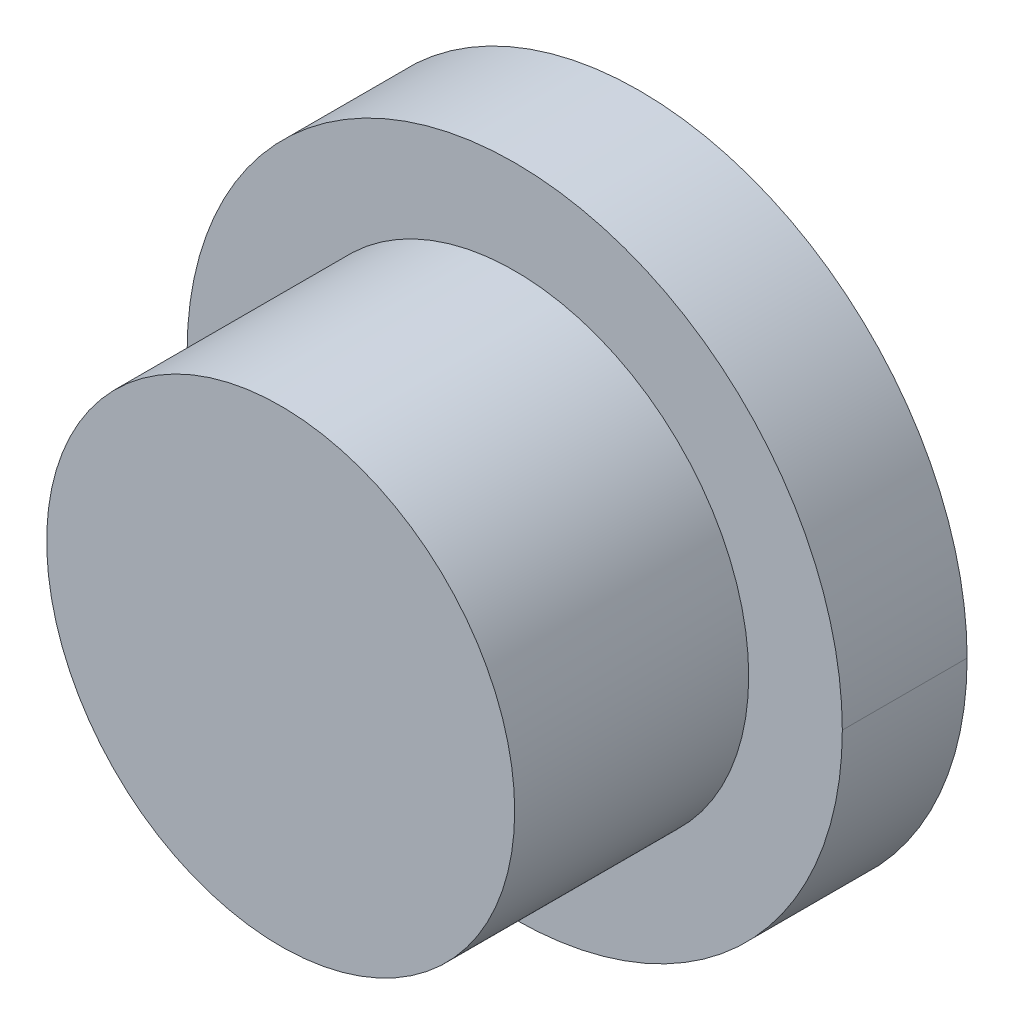
ISO-10303-21;
HEADER;
FILE_DESCRIPTION(('STEP AP214'),'2;1');
FILE_NAME('part.step','',(''),(''),'','','');
FILE_SCHEMA(('AUTOMOTIVE_DESIGN { 1 0 10303 214 1 1 1 1 }'));
ENDSEC;
DATA;
#1=APPLICATION_CONTEXT('core data for automotive mechanical design processes');
#2=APPLICATION_PROTOCOL_DEFINITION('international standard','automotive_design',2000,#1);
#3=PRODUCT_CONTEXT('',#1,'mechanical');
#4=PRODUCT('Part','Part','',(#3));
#5=PRODUCT_RELATED_PRODUCT_CATEGORY('part','',(#4));
#6=PRODUCT_DEFINITION_FORMATION('','',#4);
#7=PRODUCT_DEFINITION_CONTEXT('part definition',#1,'design');
#8=PRODUCT_DEFINITION('design','',#6,#7);
#9=PRODUCT_DEFINITION_SHAPE('','',#8);
#10=(LENGTH_UNIT() NAMED_UNIT(*) SI_UNIT(.MILLI.,.METRE.));
#11=(NAMED_UNIT(*) PLANE_ANGLE_UNIT() SI_UNIT($,.RADIAN.));
#12=(NAMED_UNIT(*) SI_UNIT($,.STERADIAN.) SOLID_ANGLE_UNIT());
#13=UNCERTAINTY_MEASURE_WITH_UNIT(LENGTH_MEASURE(1.E-05),#10,'distance_accuracy_value','');
#14=(GEOMETRIC_REPRESENTATION_CONTEXT(3) GLOBAL_UNCERTAINTY_ASSIGNED_CONTEXT((#13)) GLOBAL_UNIT_ASSIGNED_CONTEXT((#10,
#11,#12)) REPRESENTATION_CONTEXT('',''));
#15=CARTESIAN_POINT('',(0.,0.,0.));
#16=DIRECTION('',(0.,0.,1.));
#17=DIRECTION('',(1.,0.,0.));
#18=AXIS2_PLACEMENT_3D('',#15,#16,#17);
#19=CARTESIAN_POINT('',(0.,0.,-4.));
#20=DIRECTION('',(0.,0.,1.));
#21=DIRECTION('',(1.,0.,0.));
#22=AXIS2_PLACEMENT_3D('',#19,#20,#21);
#23=CYLINDRICAL_SURFACE('',#22,10.5);
#24=CARTESIAN_POINT('',(0.,0.,-4.));
#25=DIRECTION('',(0.,0.,-1.));
#26=DIRECTION('',(-1.,0.,0.));
#27=AXIS2_PLACEMENT_3D('',#24,#25,#26);
#28=CIRCLE('',#27,10.5);
#29=CARTESIAN_POINT('',(-10.5,0.,-4.));
#30=VERTEX_POINT('',#29);
#31=CARTESIAN_POINT('',(10.5,0.,-4.));
#32=VERTEX_POINT('',#31);
#33=EDGE_CURVE('E71',#30,#32,#28,.T.);
#34=ORIENTED_EDGE('',*,*,#33,.F.);
#35=DIRECTION('',(0.,0.,1.));
#36=VECTOR('',#35,1.);
#37=CARTESIAN_POINT('',(-10.5,0.,-4.));
#38=LINE('',#37,#36);
#39=CARTESIAN_POINT('',(-10.5,0.,0.));
#40=VERTEX_POINT('',#39);
#41=EDGE_CURVE('E11',#30,#40,#38,.T.);
#42=ORIENTED_EDGE('',*,*,#41,.T.);
#43=CARTESIAN_POINT('',(0.,0.,0.));
#44=DIRECTION('',(0.,0.,-1.));
#45=DIRECTION('',(-1.,0.,0.));
#46=AXIS2_PLACEMENT_3D('',#43,#44,#45);
#47=CIRCLE('',#46,10.5);
#48=CARTESIAN_POINT('',(10.5,0.,0.));
#49=VERTEX_POINT('',#48);
#50=EDGE_CURVE('E59',#40,#49,#47,.T.);
#51=ORIENTED_EDGE('',*,*,#50,.T.);
#52=DIRECTION('',(0.,0.,1.));
#53=VECTOR('',#52,1.);
#54=CARTESIAN_POINT('',(10.5,0.,-4.));
#55=LINE('',#54,#53);
#56=EDGE_CURVE('E111',#32,#49,#55,.T.);
#57=ORIENTED_EDGE('',*,*,#56,.F.);
#58=EDGE_LOOP('',(#34,#42,#51,#57));
#59=FACE_BOUND('',#58,.T.);
#60=ADVANCED_FACE('F48',(#59),#23,.T.);
#61=CARTESIAN_POINT('',(0.,0.,5.));
#62=DIRECTION('',(0.,0.,-1.));
#63=DIRECTION('',(-1.,0.,0.));
#64=AXIS2_PLACEMENT_3D('',#61,#62,#63);
#65=CYLINDRICAL_SURFACE('',#64,7.5);
#66=DIRECTION('',(0.,0.,-1.));
#67=VECTOR('',#66,1.);
#68=CARTESIAN_POINT('',(-7.5,0.,5.));
#69=LINE('',#68,#67);
#70=CARTESIAN_POINT('',(-7.5,0.,5.));
#71=VERTEX_POINT('',#70);
#72=CARTESIAN_POINT('',(-7.5,0.,0.));
#73=VERTEX_POINT('',#72);
#74=EDGE_CURVE('E105',#71,#73,#69,.T.);
#75=ORIENTED_EDGE('',*,*,#74,.F.);
#76=ORIENTED_EDGE('',*,*,#74,.T.);
#77=CARTESIAN_POINT('',(0.,0.,0.));
#78=DIRECTION('',(0.,0.,1.));
#79=DIRECTION('',(1.,0.,0.));
#80=AXIS2_PLACEMENT_3D('',#77,#78,#79);
#81=CIRCLE('',#80,7.5);
#82=CARTESIAN_POINT('',(7.5,0.,0.));
#83=VERTEX_POINT('',#82);
#84=EDGE_CURVE('E102',#73,#83,#81,.T.);
#85=ORIENTED_EDGE('',*,*,#84,.T.);
#86=DIRECTION('',(0.,0.,-1.));
#87=VECTOR('',#86,1.);
#88=CARTESIAN_POINT('',(7.5,0.,5.));
#89=LINE('',#88,#87);
#90=CARTESIAN_POINT('',(7.5,0.,5.));
#91=VERTEX_POINT('',#90);
#92=EDGE_CURVE('E94',#91,#83,#89,.T.);
#93=ORIENTED_EDGE('',*,*,#92,.F.);
#94=ORIENTED_EDGE('',*,*,#92,.T.);
#95=CARTESIAN_POINT('',(0.,0.,0.));
#96=DIRECTION('',(0.,0.,1.));
#97=DIRECTION('',(1.,0.,0.));
#98=AXIS2_PLACEMENT_3D('',#95,#96,#97);
#99=CIRCLE('',#98,7.5);
#100=EDGE_CURVE('E100',#83,#73,#99,.T.);
#101=ORIENTED_EDGE('',*,*,#100,.T.);
#102=EDGE_LOOP('',(#75,#76,#85,#93,#94,#101));
#103=FACE_BOUND('',#102,.T.);
#104=CARTESIAN_POINT('',(0.,0.,7.5));
#105=DIRECTION('',(0.,0.,1.));
#106=DIRECTION('',(1.,0.,0.));
#107=AXIS2_PLACEMENT_3D('',#104,#105,#106);
#108=CIRCLE('',#107,7.5);
#109=CARTESIAN_POINT('',(7.5,0.,7.5));
#110=VERTEX_POINT('',#109);
#111=EDGE_CURVE('E184',#110,#110,#108,.T.);
#112=ORIENTED_EDGE('',*,*,#111,.F.);
#113=EDGE_LOOP('',(#112));
#114=FACE_BOUND('',#113,.T.);
#115=ADVANCED_FACE('F107',(#103,#114),#65,.T.);
#116=CARTESIAN_POINT('',(0.,0.,-4.));
#117=DIRECTION('',(0.,0.,1.));
#118=DIRECTION('',(1.,0.,0.));
#119=AXIS2_PLACEMENT_3D('',#116,#117,#118);
#120=CYLINDRICAL_SURFACE('',#119,10.5);
#121=ORIENTED_EDGE('',*,*,#41,.F.);
#122=CARTESIAN_POINT('',(0.,0.,-4.));
#123=DIRECTION('',(0.,0.,-1.));
#124=DIRECTION('',(-1.,0.,0.));
#125=AXIS2_PLACEMENT_3D('',#122,#123,#124);
#126=CIRCLE('',#125,10.5);
#127=EDGE_CURVE('E122',#32,#30,#126,.T.);
#128=ORIENTED_EDGE('',*,*,#127,.F.);
#129=ORIENTED_EDGE('',*,*,#56,.T.);
#130=CARTESIAN_POINT('',(0.,0.,0.));
#131=DIRECTION('',(0.,0.,-1.));
#132=DIRECTION('',(-1.,0.,0.));
#133=AXIS2_PLACEMENT_3D('',#130,#131,#132);
#134=CIRCLE('',#133,10.5);
#135=EDGE_CURVE('E118',#49,#40,#134,.T.);
#136=ORIENTED_EDGE('',*,*,#135,.T.);
#137=EDGE_LOOP('',(#121,#128,#129,#136));
#138=FACE_BOUND('',#137,.T.);
#139=ADVANCED_FACE('F151',(#138),#120,.T.);
#140=CARTESIAN_POINT('',(0.,0.,-4.));
#141=DIRECTION('',(0.,0.,-1.));
#142=DIRECTION('',(0.,-1.,0.));
#143=AXIS2_PLACEMENT_3D('',#140,#141,#142);
#144=PLANE('',#143);
#145=CARTESIAN_POINT('',(0.,0.,-4.));
#146=DIRECTION('',(0.,0.,-1.));
#147=DIRECTION('',(0.,1.,0.));
#148=AXIS2_PLACEMENT_3D('',#145,#146,#147);
#149=CIRCLE('',#148,9.75);
#150=CARTESIAN_POINT('',(0.,9.75,-4.));
#151=VERTEX_POINT('',#150);
#152=EDGE_CURVE('E141',#151,#151,#149,.T.);
#153=ORIENTED_EDGE('',*,*,#152,.F.);
#154=EDGE_LOOP('',(#153));
#155=FACE_BOUND('',#154,.T.);
#156=ORIENTED_EDGE('',*,*,#127,.T.);
#157=ORIENTED_EDGE('',*,*,#33,.T.);
#158=EDGE_LOOP('',(#156,#157));
#159=FACE_BOUND('',#158,.T.);
#160=ADVANCED_FACE('F152',(#155,#159),#144,.T.);
#161=CARTESIAN_POINT('',(0.,0.,0.));
#162=DIRECTION('',(0.,0.,-1.));
#163=DIRECTION('',(0.,-1.,0.));
#164=AXIS2_PLACEMENT_3D('',#161,#162,#163);
#165=PLANE('',#164);
#166=ORIENTED_EDGE('',*,*,#135,.F.);
#167=ORIENTED_EDGE('',*,*,#50,.F.);
#168=EDGE_LOOP('',(#166,#167));
#169=FACE_BOUND('',#168,.T.);
#170=ORIENTED_EDGE('',*,*,#84,.F.);
#171=ORIENTED_EDGE('',*,*,#100,.F.);
#172=EDGE_LOOP('',(#170,#171));
#173=FACE_BOUND('',#172,.T.);
#174=ADVANCED_FACE('F101',(#169,#173),#165,.F.);
#175=CARTESIAN_POINT('',(0.,0.,-4.));
#176=DIRECTION('',(0.,0.,-1.));
#177=DIRECTION('',(0.,1.,0.));
#178=AXIS2_PLACEMENT_3D('',#175,#176,#177);
#179=CONICAL_SURFACE('',#178,9.75,0.785398163397447);
#180=CARTESIAN_POINT('',(0.,0.,-3.25));
#181=DIRECTION('',(0.,0.,-1.));
#182=DIRECTION('',(0.,1.,0.));
#183=AXIS2_PLACEMENT_3D('',#180,#181,#182);
#184=CIRCLE('',#183,9.);
#185=CARTESIAN_POINT('',(0.,9.,-3.25));
#186=VERTEX_POINT('',#185);
#187=EDGE_CURVE('E136',#186,#186,#184,.T.);
#188=ORIENTED_EDGE('',*,*,#187,.F.);
#189=EDGE_LOOP('',(#188));
#190=FACE_BOUND('',#189,.T.);
#191=ORIENTED_EDGE('',*,*,#152,.T.);
#192=EDGE_LOOP('',(#191));
#193=FACE_BOUND('',#192,.T.);
#194=ADVANCED_FACE('F159',(#190,#193),#179,.F.);
#195=CARTESIAN_POINT('',(0.,0.,-1.));
#196=DIRECTION('',(0.,0.,-1.));
#197=DIRECTION('',(0.,-1.,0.));
#198=AXIS2_PLACEMENT_3D('',#195,#196,#197);
#199=PLANE('',#198);
#200=CARTESIAN_POINT('',(0.,0.,-1.));
#201=DIRECTION('',(0.,0.,-1.));
#202=DIRECTION('',(-1.,0.,0.));
#203=AXIS2_PLACEMENT_3D('',#200,#201,#202);
#204=CIRCLE('',#203,9.);
#205=CARTESIAN_POINT('',(-9.,0.,-1.));
#206=VERTEX_POINT('',#205);
#207=EDGE_CURVE('E129',#206,#206,#204,.T.);
#208=ORIENTED_EDGE('',*,*,#207,.T.);
#209=EDGE_LOOP('',(#208));
#210=FACE_BOUND('',#209,.T.);
#211=ADVANCED_FACE('F50',(#210),#199,.T.);
#212=CARTESIAN_POINT('',(0.,0.,-1.));
#213=DIRECTION('',(0.,0.,-1.));
#214=DIRECTION('',(-1.,0.,0.));
#215=AXIS2_PLACEMENT_3D('',#212,#213,#214);
#216=CYLINDRICAL_SURFACE('',#215,9.);
#217=ORIENTED_EDGE('',*,*,#187,.T.);
#218=EDGE_LOOP('',(#217));
#219=FACE_BOUND('',#218,.T.);
#220=ORIENTED_EDGE('',*,*,#207,.F.);
#221=EDGE_LOOP('',(#220));
#222=FACE_BOUND('',#221,.T.);
#223=ADVANCED_FACE('F170',(#219,#222),#216,.F.);
#224=CARTESIAN_POINT('',(0.,0.,7.5));
#225=DIRECTION('',(0.,0.,1.));
#226=DIRECTION('',(1.,0.,0.));
#227=AXIS2_PLACEMENT_3D('',#224,#225,#226);
#228=PLANE('',#227);
#229=ORIENTED_EDGE('',*,*,#111,.T.);
#230=EDGE_LOOP('',(#229));
#231=FACE_BOUND('',#230,.T.);
#232=ADVANCED_FACE('F173',(#231),#228,.T.);
#233=CLOSED_SHELL('',(#60,#115,#139,#160,#174,#194,#211,#223,#232));
#234=MANIFOLD_SOLID_BREP('B2',#233);
#235=ADVANCED_BREP_SHAPE_REPRESENTATION('',(#18,#234),#14);
#236=SHAPE_DEFINITION_REPRESENTATION(#9,#235);
ENDSEC;
END-ISO-10303-21;
